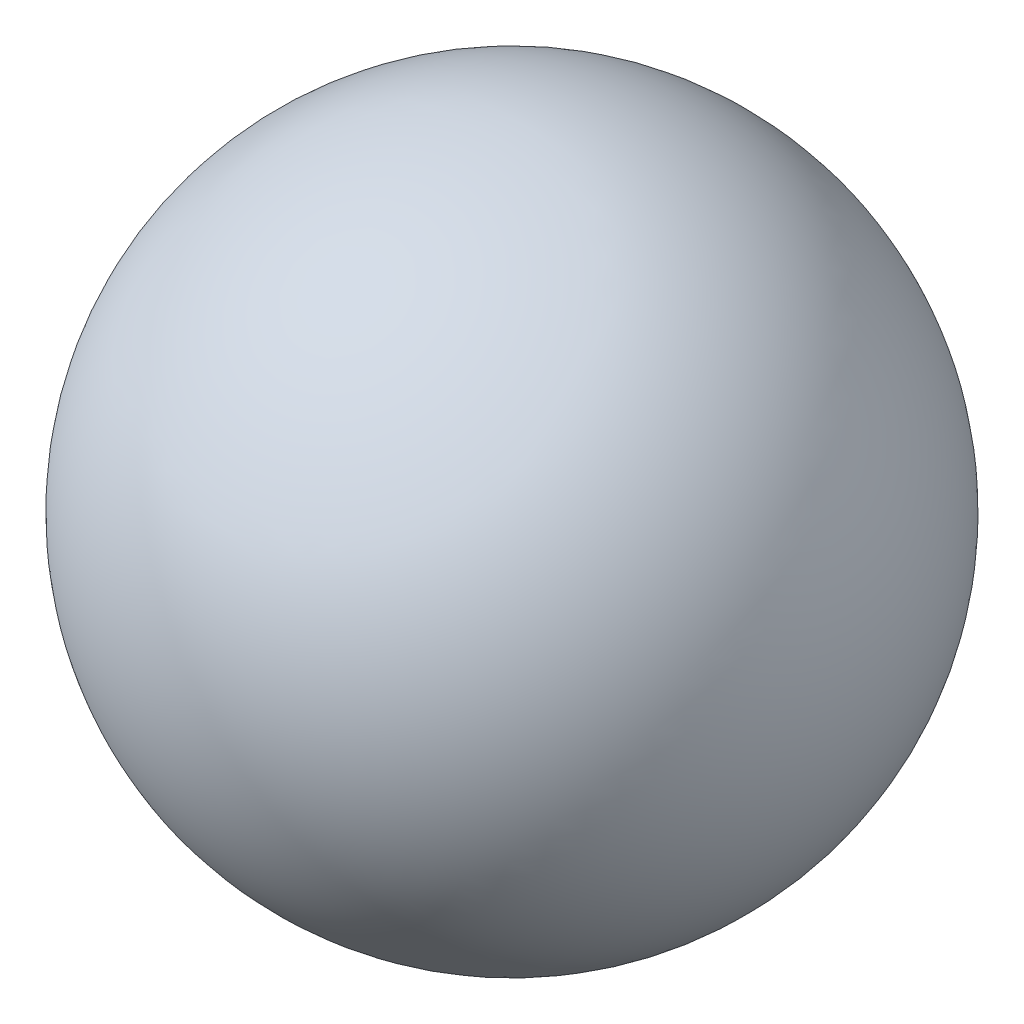
ISO-10303-21;
HEADER;
FILE_DESCRIPTION(('STEP AP214'),'2;1');
FILE_NAME('part.step','',(''),(''),'','','');
FILE_SCHEMA(('AUTOMOTIVE_DESIGN { 1 0 10303 214 1 1 1 1 }'));
ENDSEC;
DATA;
#1=APPLICATION_CONTEXT('core data for automotive mechanical design processes');
#2=APPLICATION_PROTOCOL_DEFINITION('international standard','automotive_design',2000,#1);
#3=PRODUCT_CONTEXT('',#1,'mechanical');
#4=PRODUCT('Part','Part','',(#3));
#5=PRODUCT_RELATED_PRODUCT_CATEGORY('part','',(#4));
#6=PRODUCT_DEFINITION_FORMATION('','',#4);
#7=PRODUCT_DEFINITION_CONTEXT('part definition',#1,'design');
#8=PRODUCT_DEFINITION('design','',#6,#7);
#9=PRODUCT_DEFINITION_SHAPE('','',#8);
#10=(LENGTH_UNIT() NAMED_UNIT(*) SI_UNIT(.MILLI.,.METRE.));
#11=(NAMED_UNIT(*) PLANE_ANGLE_UNIT() SI_UNIT($,.RADIAN.));
#12=(NAMED_UNIT(*) SI_UNIT($,.STERADIAN.) SOLID_ANGLE_UNIT());
#13=UNCERTAINTY_MEASURE_WITH_UNIT(LENGTH_MEASURE(1.E-05),#10,'distance_accuracy_value','');
#14=(GEOMETRIC_REPRESENTATION_CONTEXT(3) GLOBAL_UNCERTAINTY_ASSIGNED_CONTEXT((#13)) GLOBAL_UNIT_ASSIGNED_CONTEXT((#10,
#11,#12)) REPRESENTATION_CONTEXT('',''));
#15=CARTESIAN_POINT('',(0.,0.,0.));
#16=DIRECTION('',(0.,0.,1.));
#17=DIRECTION('',(1.,0.,0.));
#18=AXIS2_PLACEMENT_3D('',#15,#16,#17);
#19=CARTESIAN_POINT('',(0.,0.,0.));
#20=DIRECTION('',(0.,3.1279145940033E-13,0.999999999999654));
#21=DIRECTION('',(0.,0.999999999999998,3.72299413520238E-13));
#22=AXIS2_PLACEMENT_3D('',#19,#20,#21);
#23=SPHERICAL_SURFACE('',#22,1.625);
#24=CARTESIAN_POINT('',(1.20830428995689E-13,5.08286121525536E-13,1.62499999999944));
#25=VERTEX_POINT('',#24);
#26=VERTEX_LOOP('',#25);
#27=FACE_BOUND('',#26,.T.);
#28=ADVANCED_FACE('F35',(#27),#23,.T.);
#29=CLOSED_SHELL('',(#28));
#30=MANIFOLD_SOLID_BREP('B2',#29);
#31=ADVANCED_BREP_SHAPE_REPRESENTATION('',(#18,#30),#14);
#32=SHAPE_DEFINITION_REPRESENTATION(#9,#31);
ENDSEC;
END-ISO-10303-21;
